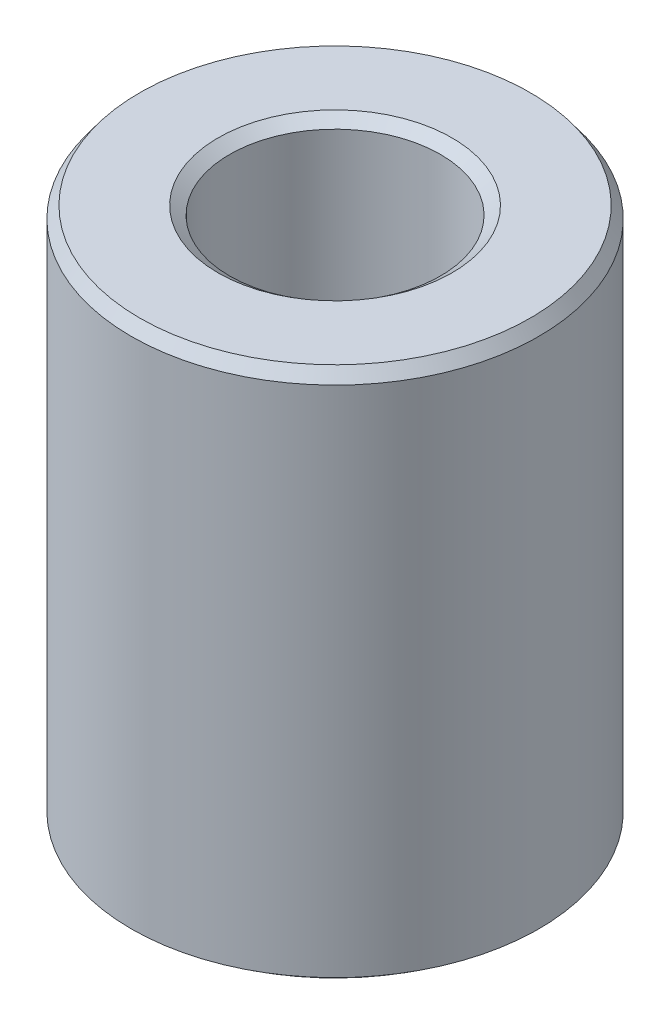
ISO-10303-21;
HEADER;
FILE_DESCRIPTION(('STEP AP214'),'2;1');
FILE_NAME('part.step','',(''),(''),'','','');
FILE_SCHEMA(('AUTOMOTIVE_DESIGN { 1 0 10303 214 1 1 1 1 }'));
ENDSEC;
DATA;
#1=APPLICATION_CONTEXT('core data for automotive mechanical design processes');
#2=APPLICATION_PROTOCOL_DEFINITION('international standard','automotive_design',2000,#1);
#3=PRODUCT_CONTEXT('',#1,'mechanical');
#4=PRODUCT('Part','Part','',(#3));
#5=PRODUCT_RELATED_PRODUCT_CATEGORY('part','',(#4));
#6=PRODUCT_DEFINITION_FORMATION('','',#4);
#7=PRODUCT_DEFINITION_CONTEXT('part definition',#1,'design');
#8=PRODUCT_DEFINITION('design','',#6,#7);
#9=PRODUCT_DEFINITION_SHAPE('','',#8);
#10=(LENGTH_UNIT() NAMED_UNIT(*) SI_UNIT(.MILLI.,.METRE.));
#11=(NAMED_UNIT(*) PLANE_ANGLE_UNIT() SI_UNIT($,.RADIAN.));
#12=(NAMED_UNIT(*) SI_UNIT($,.STERADIAN.) SOLID_ANGLE_UNIT());
#13=UNCERTAINTY_MEASURE_WITH_UNIT(LENGTH_MEASURE(1.E-05),#10,'distance_accuracy_value','');
#14=(GEOMETRIC_REPRESENTATION_CONTEXT(3) GLOBAL_UNCERTAINTY_ASSIGNED_CONTEXT((#13)) GLOBAL_UNIT_ASSIGNED_CONTEXT((#10,
#11,#12)) REPRESENTATION_CONTEXT('',''));
#15=CARTESIAN_POINT('',(0.,0.,0.));
#16=DIRECTION('',(0.,0.,1.));
#17=DIRECTION('',(1.,0.,0.));
#18=AXIS2_PLACEMENT_3D('',#15,#16,#17);
#19=CARTESIAN_POINT('',(0.,65.4191502049317,0.));
#20=DIRECTION('',(0.,-1.,0.));
#21=DIRECTION('',(0.,0.,-1.));
#22=AXIS2_PLACEMENT_3D('',#19,#20,#21);
#23=CYLINDRICAL_SURFACE('',#22,25.);
#24=CARTESIAN_POINT('',(0.,1.04470584842975,0.));
#25=DIRECTION('',(0.,1.,0.));
#26=DIRECTION('',(0.,0.,1.));
#27=AXIS2_PLACEMENT_3D('',#24,#25,#26);
#28=CIRCLE('',#27,25.);
#29=CARTESIAN_POINT('',(0.,1.04470584842975,25.));
#30=VERTEX_POINT('',#29);
#31=EDGE_CURVE('E10',#30,#30,#28,.T.);
#32=ORIENTED_EDGE('',*,*,#31,.T.);
#33=EDGE_LOOP('',(#32));
#34=FACE_BOUND('',#33,.T.);
#35=CARTESIAN_POINT('',(0.,63.9961361823392,0.));
#36=DIRECTION('',(0.,1.,0.));
#37=DIRECTION('',(0.,0.,1.));
#38=AXIS2_PLACEMENT_3D('',#35,#36,#37);
#39=CIRCLE('',#38,25.);
#40=CARTESIAN_POINT('',(0.,63.9961361823392,25.));
#41=VERTEX_POINT('',#40);
#42=EDGE_CURVE('E50',#41,#41,#39,.F.);
#43=ORIENTED_EDGE('',*,*,#42,.T.);
#44=EDGE_LOOP('',(#43));
#45=FACE_BOUND('',#44,.T.);
#46=ADVANCED_FACE('F39',(#34,#45),#23,.T.);
#47=CARTESIAN_POINT('',(0.,65.4191502049317,0.));
#48=DIRECTION('',(0.,1.,0.));
#49=DIRECTION('',(0.,0.,1.));
#50=AXIS2_PLACEMENT_3D('',#47,#48,#49);
#51=PLANE('',#50);
#52=CARTESIAN_POINT('',(0.,65.4191502049317,0.));
#53=DIRECTION('',(0.,1.,0.));
#54=DIRECTION('',(0.,0.,1.));
#55=AXIS2_PLACEMENT_3D('',#52,#53,#54);
#56=CIRCLE('',#55,14.3521946844181);
#57=CARTESIAN_POINT('',(0.,65.4191502049317,14.3521946844181));
#58=VERTEX_POINT('',#57);
#59=EDGE_CURVE('E58',#58,#58,#56,.F.);
#60=ORIENTED_EDGE('',*,*,#59,.T.);
#61=EDGE_LOOP('',(#60));
#62=FACE_BOUND('',#61,.T.);
#63=CARTESIAN_POINT('',(0.,65.4191502049317,0.));
#64=DIRECTION('',(0.,1.,0.));
#65=DIRECTION('',(0.,0.,1.));
#66=AXIS2_PLACEMENT_3D('',#63,#64,#65);
#67=CIRCLE('',#66,23.9552941515702);
#68=CARTESIAN_POINT('',(0.,65.4191502049317,23.9552941515702));
#69=VERTEX_POINT('',#68);
#70=EDGE_CURVE('E61',#69,#69,#67,.T.);
#71=ORIENTED_EDGE('',*,*,#70,.T.);
#72=EDGE_LOOP('',(#71));
#73=FACE_BOUND('',#72,.T.);
#74=ADVANCED_FACE('F88',(#62,#73),#51,.T.);
#75=CARTESIAN_POINT('',(0.,0.,0.));
#76=DIRECTION('',(0.,1.,0.));
#77=DIRECTION('',(0.,0.,1.));
#78=AXIS2_PLACEMENT_3D('',#75,#76,#77);
#79=PLANE('',#78);
#80=CARTESIAN_POINT('',(0.,0.,0.));
#81=DIRECTION('',(0.,1.,0.));
#82=DIRECTION('',(0.,0.,1.));
#83=AXIS2_PLACEMENT_3D('',#80,#81,#82);
#84=CIRCLE('',#83,13.9738865102554);
#85=CARTESIAN_POINT('',(0.,0.,13.9738865102554));
#86=VERTEX_POINT('',#85);
#87=EDGE_CURVE('E51',#86,#86,#84,.T.);
#88=ORIENTED_EDGE('',*,*,#87,.T.);
#89=EDGE_LOOP('',(#88));
#90=FACE_BOUND('',#89,.T.);
#91=CARTESIAN_POINT('',(0.,0.,0.));
#92=DIRECTION('',(0.,1.,0.));
#93=DIRECTION('',(0.,0.,1.));
#94=AXIS2_PLACEMENT_3D('',#91,#92,#93);
#95=CIRCLE('',#94,23.5769859774076);
#96=CARTESIAN_POINT('',(0.,0.,23.5769859774076));
#97=VERTEX_POINT('',#96);
#98=EDGE_CURVE('E54',#97,#97,#95,.F.);
#99=ORIENTED_EDGE('',*,*,#98,.T.);
#100=EDGE_LOOP('',(#99));
#101=FACE_BOUND('',#100,.T.);
#102=ADVANCED_FACE('F83',(#90,#101),#79,.F.);
#103=CARTESIAN_POINT('',(0.,65.4191502049317,0.));
#104=DIRECTION('',(0.,-1.,0.));
#105=DIRECTION('',(0.,0.,-1.));
#106=AXIS2_PLACEMENT_3D('',#103,#104,#105);
#107=CYLINDRICAL_SURFACE('',#106,12.9291806618257);
#108=CARTESIAN_POINT('',(0.,64.3744443565019,0.));
#109=DIRECTION('',(0.,1.,0.));
#110=DIRECTION('',(0.,0.,1.));
#111=AXIS2_PLACEMENT_3D('',#108,#109,#110);
#112=CIRCLE('',#111,12.9291806618257);
#113=CARTESIAN_POINT('',(0.,64.3744443565019,12.9291806618257));
#114=VERTEX_POINT('',#113);
#115=EDGE_CURVE('E67',#114,#114,#112,.T.);
#116=ORIENTED_EDGE('',*,*,#115,.T.);
#117=EDGE_LOOP('',(#116));
#118=FACE_BOUND('',#117,.T.);
#119=CARTESIAN_POINT('',(0.,1.42301402259241,0.));
#120=DIRECTION('',(0.,1.,0.));
#121=DIRECTION('',(0.,0.,1.));
#122=AXIS2_PLACEMENT_3D('',#119,#120,#121);
#123=CIRCLE('',#122,12.9291806618257);
#124=CARTESIAN_POINT('',(0.,1.42301402259241,12.9291806618257));
#125=VERTEX_POINT('',#124);
#126=EDGE_CURVE('E69',#125,#125,#123,.F.);
#127=ORIENTED_EDGE('',*,*,#126,.T.);
#128=EDGE_LOOP('',(#127));
#129=FACE_BOUND('',#128,.T.);
#130=ADVANCED_FACE('F71',(#118,#129),#107,.F.);
#131=CARTESIAN_POINT('',(0.,64.3744443565019,0.));
#132=DIRECTION('',(0.,1.,0.));
#133=DIRECTION('',(0.,0.,1.));
#134=AXIS2_PLACEMENT_3D('',#131,#132,#133);
#135=CONICAL_SURFACE('',#134,12.9291806618257,0.937516581851522);
#136=ORIENTED_EDGE('',*,*,#59,.F.);
#137=EDGE_LOOP('',(#136));
#138=FACE_BOUND('',#137,.T.);
#139=ORIENTED_EDGE('',*,*,#115,.F.);
#140=EDGE_LOOP('',(#139));
#141=FACE_BOUND('',#140,.T.);
#142=ADVANCED_FACE('F77',(#138,#141),#135,.F.);
#143=CARTESIAN_POINT('',(0.,0.,0.));
#144=DIRECTION('',(0.,-1.,0.));
#145=DIRECTION('',(0.,0.,-1.));
#146=AXIS2_PLACEMENT_3D('',#143,#144,#145);
#147=CONICAL_SURFACE('',#146,13.9738865102554,0.633279744943378);
#148=ORIENTED_EDGE('',*,*,#126,.F.);
#149=EDGE_LOOP('',(#148));
#150=FACE_BOUND('',#149,.T.);
#151=ORIENTED_EDGE('',*,*,#87,.F.);
#152=EDGE_LOOP('',(#151));
#153=FACE_BOUND('',#152,.T.);
#154=ADVANCED_FACE('F73',(#150,#153),#147,.F.);
#155=CARTESIAN_POINT('',(0.,1.04470584842975,0.));
#156=DIRECTION('',(0.,1.,0.));
#157=DIRECTION('',(0.,0.,1.));
#158=AXIS2_PLACEMENT_3D('',#155,#156,#157);
#159=CONICAL_SURFACE('',#158,25.,0.937516581851529);
#160=ORIENTED_EDGE('',*,*,#98,.F.);
#161=EDGE_LOOP('',(#160));
#162=FACE_BOUND('',#161,.T.);
#163=ORIENTED_EDGE('',*,*,#31,.F.);
#164=EDGE_LOOP('',(#163));
#165=FACE_BOUND('',#164,.T.);
#166=ADVANCED_FACE('F76',(#162,#165),#159,.T.);
#167=CARTESIAN_POINT('',(0.,65.4191502049317,0.));
#168=DIRECTION('',(0.,-1.,0.));
#169=DIRECTION('',(0.,0.,-1.));
#170=AXIS2_PLACEMENT_3D('',#167,#168,#169);
#171=CONICAL_SURFACE('',#170,23.9552941515702,0.633279744943374);
#172=ORIENTED_EDGE('',*,*,#42,.F.);
#173=EDGE_LOOP('',(#172));
#174=FACE_BOUND('',#173,.T.);
#175=ORIENTED_EDGE('',*,*,#70,.F.);
#176=EDGE_LOOP('',(#175));
#177=FACE_BOUND('',#176,.T.);
#178=ADVANCED_FACE('F45',(#174,#177),#171,.T.);
#179=CLOSED_SHELL('',(#46,#74,#102,#130,#142,#154,#166,#178));
#180=MANIFOLD_SOLID_BREP('B2',#179);
#181=ADVANCED_BREP_SHAPE_REPRESENTATION('',(#18,#180),#14);
#182=SHAPE_DEFINITION_REPRESENTATION(#9,#181);
ENDSEC;
END-ISO-10303-21;
